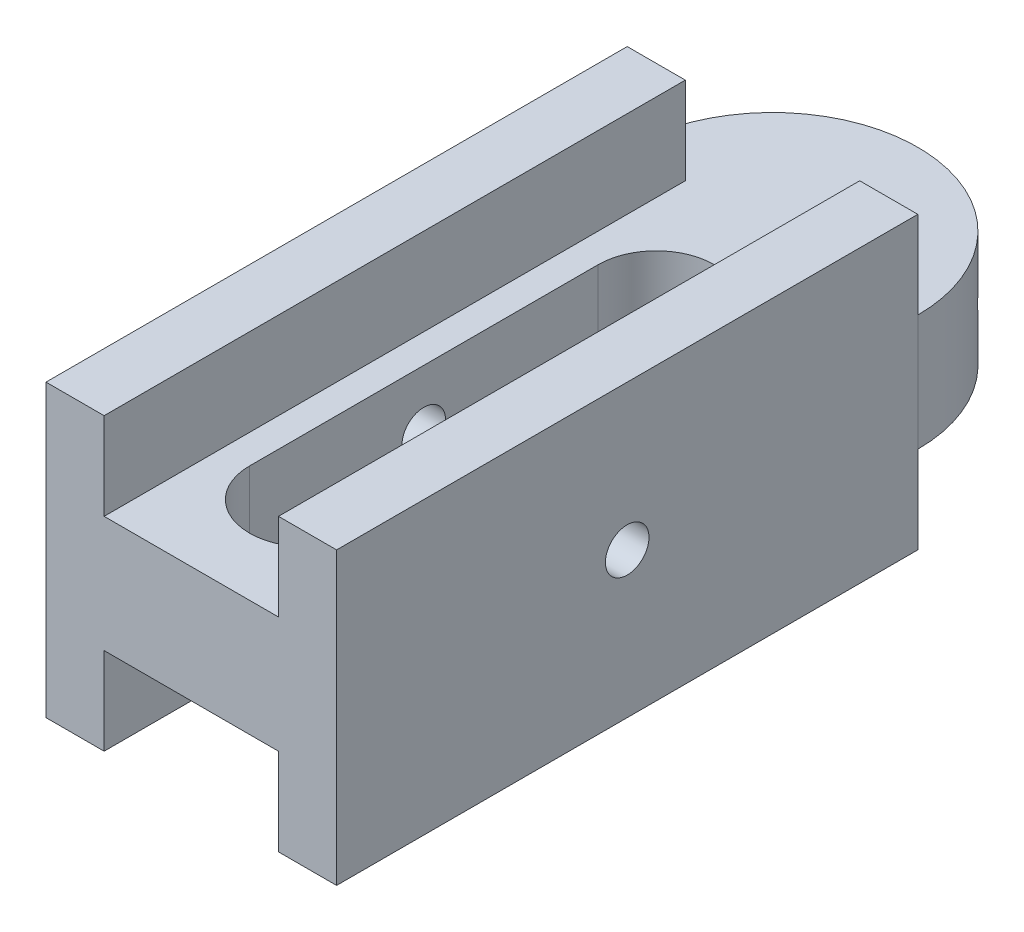
ISO-10303-21;
HEADER;
FILE_DESCRIPTION(('STEP AP214'),'2;1');
FILE_NAME('part.step','',(''),(''),'','','');
FILE_SCHEMA(('AUTOMOTIVE_DESIGN { 1 0 10303 214 1 1 1 1 }'));
ENDSEC;
DATA;
#1=APPLICATION_CONTEXT('core data for automotive mechanical design processes');
#2=APPLICATION_PROTOCOL_DEFINITION('international standard','automotive_design',2000,#1);
#3=PRODUCT_CONTEXT('',#1,'mechanical');
#4=PRODUCT('Part','Part','',(#3));
#5=PRODUCT_RELATED_PRODUCT_CATEGORY('part','',(#4));
#6=PRODUCT_DEFINITION_FORMATION('','',#4);
#7=PRODUCT_DEFINITION_CONTEXT('part definition',#1,'design');
#8=PRODUCT_DEFINITION('design','',#6,#7);
#9=PRODUCT_DEFINITION_SHAPE('','',#8);
#10=(LENGTH_UNIT() NAMED_UNIT(*) SI_UNIT(.MILLI.,.METRE.));
#11=(NAMED_UNIT(*) PLANE_ANGLE_UNIT() SI_UNIT($,.RADIAN.));
#12=(NAMED_UNIT(*) SI_UNIT($,.STERADIAN.) SOLID_ANGLE_UNIT());
#13=UNCERTAINTY_MEASURE_WITH_UNIT(LENGTH_MEASURE(1.E-05),#10,'distance_accuracy_value','');
#14=(GEOMETRIC_REPRESENTATION_CONTEXT(3) GLOBAL_UNCERTAINTY_ASSIGNED_CONTEXT((#13)) GLOBAL_UNIT_ASSIGNED_CONTEXT((#10,
#11,#12)) REPRESENTATION_CONTEXT('',''));
#15=CARTESIAN_POINT('',(0.,0.,0.));
#16=DIRECTION('',(0.,0.,1.));
#17=DIRECTION('',(1.,0.,0.));
#18=AXIS2_PLACEMENT_3D('',#15,#16,#17);
#19=CARTESIAN_POINT('',(-7.9375,0.,15.875));
#20=DIRECTION('',(1.,0.,0.));
#21=DIRECTION('',(0.,0.,-1.));
#22=AXIS2_PLACEMENT_3D('',#19,#20,#21);
#23=CYLINDRICAL_SURFACE('',#22,1.190625);
#24=CARTESIAN_POINT('',(-3.175,0.,15.875));
#25=DIRECTION('',(-1.,0.,0.));
#26=DIRECTION('',(0.,0.,1.));
#27=AXIS2_PLACEMENT_3D('',#24,#25,#26);
#28=CIRCLE('',#27,1.190625);
#29=CARTESIAN_POINT('',(-3.175,0.,17.065625));
#30=VERTEX_POINT('',#29);
#31=EDGE_CURVE('E37',#30,#30,#28,.F.);
#32=ORIENTED_EDGE('',*,*,#31,.T.);
#33=EDGE_LOOP('',(#32));
#34=FACE_BOUND('',#33,.T.);
#35=CARTESIAN_POINT('',(-7.9375,0.,15.875));
#36=DIRECTION('',(1.,0.,0.));
#37=DIRECTION('',(0.,0.,-1.));
#38=AXIS2_PLACEMENT_3D('',#35,#36,#37);
#39=CIRCLE('',#38,1.190625);
#40=CARTESIAN_POINT('',(-7.9375,0.,14.684375));
#41=VERTEX_POINT('',#40);
#42=EDGE_CURVE('E447',#41,#41,#39,.T.);
#43=ORIENTED_EDGE('',*,*,#42,.F.);
#44=EDGE_LOOP('',(#43));
#45=FACE_BOUND('',#44,.T.);
#46=ADVANCED_FACE('F33',(#34,#45),#23,.F.);
#47=CARTESIAN_POINT('',(-7.9375,-7.9375,31.75));
#48=DIRECTION('',(0.,1.,0.));
#49=DIRECTION('',(0.,0.,1.));
#50=AXIS2_PLACEMENT_3D('',#47,#48,#49);
#51=PLANE('',#50);
#52=DIRECTION('',(1.,0.,0.));
#53=VECTOR('',#52,1.);
#54=CARTESIAN_POINT('',(-7.9375,-7.9375,31.75));
#55=LINE('',#54,#53);
#56=CARTESIAN_POINT('',(4.7625,-7.9375,31.75));
#57=VERTEX_POINT('',#56);
#58=CARTESIAN_POINT('',(7.9375,-7.9375,31.75));
#59=VERTEX_POINT('',#58);
#60=EDGE_CURVE('E377',#57,#59,#55,.T.);
#61=ORIENTED_EDGE('',*,*,#60,.F.);
#62=DIRECTION('',(0.,0.,-1.));
#63=VECTOR('',#62,1.);
#64=CARTESIAN_POINT('',(4.7625,-7.9375,31.75));
#65=LINE('',#64,#63);
#66=CARTESIAN_POINT('',(4.7625,-7.9375,0.));
#67=VERTEX_POINT('',#66);
#68=EDGE_CURVE('E216',#57,#67,#65,.T.);
#69=ORIENTED_EDGE('',*,*,#68,.T.);
#70=DIRECTION('',(1.,0.,0.));
#71=VECTOR('',#70,1.);
#72=CARTESIAN_POINT('',(-7.9375,-7.9375,0.));
#73=LINE('',#72,#71);
#74=CARTESIAN_POINT('',(7.9375,-7.9375,0.));
#75=VERTEX_POINT('',#74);
#76=EDGE_CURVE('E393',#67,#75,#73,.T.);
#77=ORIENTED_EDGE('',*,*,#76,.T.);
#78=DIRECTION('',(0.,0.,-1.));
#79=VECTOR('',#78,1.);
#80=CARTESIAN_POINT('',(7.9375,-7.9375,31.75));
#81=LINE('',#80,#79);
#82=EDGE_CURVE('E381',#59,#75,#81,.T.);
#83=ORIENTED_EDGE('',*,*,#82,.F.);
#84=EDGE_LOOP('',(#61,#69,#77,#83));
#85=FACE_BOUND('',#84,.T.);
#86=ADVANCED_FACE('F312',(#85),#51,.F.);
#87=CARTESIAN_POINT('',(0.,0.,0.));
#88=DIRECTION('',(0.,0.,1.));
#89=DIRECTION('',(1.,0.,0.));
#90=AXIS2_PLACEMENT_3D('',#87,#88,#89);
#91=PLANE('',#90);
#92=ORIENTED_EDGE('',*,*,#76,.F.);
#93=DIRECTION('',(0.,-1.,0.));
#94=VECTOR('',#93,1.);
#95=CARTESIAN_POINT('',(4.7625,-7.9375,0.));
#96=LINE('',#95,#94);
#97=CARTESIAN_POINT('',(4.7625,-3.175,0.));
#98=VERTEX_POINT('',#97);
#99=EDGE_CURVE('E207',#98,#67,#96,.T.);
#100=ORIENTED_EDGE('',*,*,#99,.F.);
#101=DIRECTION('',(1.,0.,0.));
#102=VECTOR('',#101,1.);
#103=CARTESIAN_POINT('',(-7.9375,-3.175,0.));
#104=LINE('',#103,#102);
#105=CARTESIAN_POINT('',(7.9375,-3.175,0.));
#106=VERTEX_POINT('',#105);
#107=EDGE_CURVE('E347',#98,#106,#104,.T.);
#108=ORIENTED_EDGE('',*,*,#107,.T.);
#109=DIRECTION('',(0.,1.,0.));
#110=VECTOR('',#109,1.);
#111=CARTESIAN_POINT('',(7.9375,7.9375,0.));
#112=LINE('',#111,#110);
#113=EDGE_CURVE('E382',#75,#106,#112,.T.);
#114=ORIENTED_EDGE('',*,*,#113,.F.);
#115=EDGE_LOOP('',(#92,#100,#108,#114));
#116=FACE_BOUND('',#115,.T.);
#117=ADVANCED_FACE('F317',(#116),#91,.F.);
#118=DIRECTION('',(1.,0.,0.));
#119=VECTOR('',#118,1.);
#120=CARTESIAN_POINT('',(-7.9375,3.175,0.));
#121=LINE('',#120,#119);
#122=CARTESIAN_POINT('',(4.7625,3.175,0.));
#123=VERTEX_POINT('',#122);
#124=CARTESIAN_POINT('',(7.9375,3.175,0.));
#125=VERTEX_POINT('',#124);
#126=EDGE_CURVE('E357',#123,#125,#121,.T.);
#127=ORIENTED_EDGE('',*,*,#126,.F.);
#128=DIRECTION('',(0.,-1.,0.));
#129=VECTOR('',#128,1.);
#130=CARTESIAN_POINT('',(4.7625,7.9375,0.));
#131=LINE('',#130,#129);
#132=CARTESIAN_POINT('',(4.7625,7.9375,0.));
#133=VERTEX_POINT('',#132);
#134=EDGE_CURVE('E219',#133,#123,#131,.T.);
#135=ORIENTED_EDGE('',*,*,#134,.F.);
#136=DIRECTION('',(-1.,0.,0.));
#137=VECTOR('',#136,1.);
#138=CARTESIAN_POINT('',(-7.9375,7.9375,0.));
#139=LINE('',#138,#137);
#140=CARTESIAN_POINT('',(7.9375,7.9375,0.));
#141=VERTEX_POINT('',#140);
#142=EDGE_CURVE('E386',#141,#133,#139,.T.);
#143=ORIENTED_EDGE('',*,*,#142,.F.);
#144=EDGE_CURVE('E365',#125,#141,#112,.T.);
#145=ORIENTED_EDGE('',*,*,#144,.F.);
#146=EDGE_LOOP('',(#127,#135,#143,#145));
#147=FACE_BOUND('',#146,.T.);
#148=ADVANCED_FACE('F419',(#147),#91,.F.);
#149=CARTESIAN_POINT('',(-7.9375,7.9375,31.75));
#150=DIRECTION('',(0.,-1.,0.));
#151=DIRECTION('',(0.,0.,-1.));
#152=AXIS2_PLACEMENT_3D('',#149,#150,#151);
#153=PLANE('',#152);
#154=ORIENTED_EDGE('',*,*,#142,.T.);
#155=DIRECTION('',(0.,0.,-1.));
#156=VECTOR('',#155,1.);
#157=CARTESIAN_POINT('',(4.7625,7.9375,31.75));
#158=LINE('',#157,#156);
#159=CARTESIAN_POINT('',(4.7625,7.9375,31.75));
#160=VERTEX_POINT('',#159);
#161=EDGE_CURVE('E239',#160,#133,#158,.T.);
#162=ORIENTED_EDGE('',*,*,#161,.F.);
#163=DIRECTION('',(-1.,0.,0.));
#164=VECTOR('',#163,1.);
#165=CARTESIAN_POINT('',(-7.9375,7.9375,31.75));
#166=LINE('',#165,#164);
#167=CARTESIAN_POINT('',(7.9375,7.9375,31.75));
#168=VERTEX_POINT('',#167);
#169=EDGE_CURVE('E372',#168,#160,#166,.T.);
#170=ORIENTED_EDGE('',*,*,#169,.F.);
#171=DIRECTION('',(0.,0.,-1.));
#172=VECTOR('',#171,1.);
#173=CARTESIAN_POINT('',(7.9375,7.9375,31.75));
#174=LINE('',#173,#172);
#175=EDGE_CURVE('E292',#168,#141,#174,.T.);
#176=ORIENTED_EDGE('',*,*,#175,.T.);
#177=EDGE_LOOP('',(#154,#162,#170,#176));
#178=FACE_BOUND('',#177,.T.);
#179=ADVANCED_FACE('F409',(#178),#153,.F.);
#180=CARTESIAN_POINT('',(0.,-3.175,0.));
#181=DIRECTION('',(0.,1.,0.));
#182=DIRECTION('',(0.,0.,1.));
#183=AXIS2_PLACEMENT_3D('',#180,#181,#182);
#184=CYLINDRICAL_SURFACE('',#183,7.9375);
#185=CARTESIAN_POINT('',(3.34989133364469,0.,-7.1959804267919));
#186=CARTESIAN_POINT('',(3.34989499809781,0.0882084460911808,-7.19597989683942));
#187=CARTESIAN_POINT('',(3.35672360937426,0.176457964541401,-7.19281197356392));
#188=CARTESIAN_POINT('',(3.38375900295893,0.350460476914997,-7.18013202338388));
#189=CARTESIAN_POINT('',(3.40397648991702,0.436211415859692,-7.17061492014935));
#190=CARTESIAN_POINT('',(3.4569152870931,0.602674219074736,-7.14524303654136));
#191=CARTESIAN_POINT('',(3.48962416019968,0.683391002932965,-7.12939455931131));
#192=CARTESIAN_POINT('',(3.56624862713566,0.837683815956436,-7.0913749068931));
#193=CARTESIAN_POINT('',(3.61016359548189,0.911260243353924,-7.06920408458698));
#194=CARTESIAN_POINT('',(3.70820312500262,1.050228093618,-7.01827737298935));
#195=CARTESIAN_POINT('',(3.7624501328914,1.11550384576581,-6.98944151673078));
#196=CARTESIAN_POINT('',(3.87885992004042,1.23500758455663,-6.92551466995343));
#197=CARTESIAN_POINT('',(3.94102325368344,1.28923479677479,-6.89042324128607));
#198=CARTESIAN_POINT('',(4.0717321149676,1.38555097798518,-6.81400584849534));
#199=CARTESIAN_POINT('',(4.140328548277,1.42753002818391,-6.7726282090224));
#200=CARTESIAN_POINT('',(4.28113730580296,1.49744896256392,-6.68450885173637));
#201=CARTESIAN_POINT('',(4.35334929085493,1.52539016089282,-6.63776763653562));
#202=CARTESIAN_POINT('',(4.49806869554909,1.56608016987115,-6.5405488738458));
#203=CARTESIAN_POINT('',(4.57055968645741,1.57902430189397,-6.49012866993045));
#204=CARTESIAN_POINT('',(4.71452786965753,1.58996213604333,-6.38631393181294));
#205=CARTESIAN_POINT('',(4.78600515897521,1.58795727881274,-6.3329196847133));
#206=CARTESIAN_POINT('',(4.92487510526487,1.56920218890781,-6.22552094060531));
#207=CARTESIAN_POINT('',(4.99231143504519,1.55266234874604,-6.17153596241542));
#208=CARTESIAN_POINT('',(5.12245824178338,1.50564051097151,-6.06394765638732));
#209=CARTESIAN_POINT('',(5.18516852953866,1.4751579555204,-6.01034434390644));
#210=CARTESIAN_POINT('',(5.3048138741224,1.40092106126621,-5.90501945690866));
#211=CARTESIAN_POINT('',(5.36171004530921,1.35708429512099,-5.85331186980904));
#212=CARTESIAN_POINT('',(5.46814184152631,1.2574443398869,-5.7540105222422));
#213=CARTESIAN_POINT('',(5.51767661849346,1.20163977386431,-5.70641723602329));
#214=CARTESIAN_POINT('',(5.60930488441109,1.0784941249028,-5.61638759011891));
#215=CARTESIAN_POINT('',(5.65125362461214,1.01096891606678,-5.57405557339183));
#216=CARTESIAN_POINT('',(5.72592744900618,0.866907647609431,-5.49732084613103));
#217=CARTESIAN_POINT('',(5.75865235874522,0.790371417597928,-5.46291828557248));
#218=CARTESIAN_POINT('',(5.81440971941817,0.630204429482885,-5.40353740052564));
#219=CARTESIAN_POINT('',(5.83742127757342,0.546558838872037,-5.37857940247446));
#220=CARTESIAN_POINT('',(5.87326489155178,0.374695523588165,-5.33941735371019));
#221=CARTESIAN_POINT('',(5.88609827408279,0.286478396404705,-5.32521190143204));
#222=CARTESIAN_POINT('',(5.90123812662552,0.109593287926518,-5.30842931705236));
#223=CARTESIAN_POINT('',(5.90372096757584,0.0209588507823357,-5.30565736930055));
#224=CARTESIAN_POINT('',(5.89860197693303,-0.155651554329497,-5.31134777051729));
#225=CARTESIAN_POINT('',(5.89100071719187,-0.243627559351194,-5.31980948244438));
#226=CARTESIAN_POINT('',(5.86596471799217,-0.415557716463922,-5.34740144161377));
#227=CARTESIAN_POINT('',(5.84862496969507,-0.499542344569272,-5.36642861131444));
#228=CARTESIAN_POINT('',(5.8044590577296,-0.662087955458125,-5.41416773853641));
#229=CARTESIAN_POINT('',(5.77763211259196,-0.740648490816705,-5.44288049385945));
#230=CARTESIAN_POINT('',(5.71449639712169,-0.89124331204588,-5.50913336042268));
#231=CARTESIAN_POINT('',(5.67806859560899,-0.963179186002561,-5.5467836519133));
#232=CARTESIAN_POINT('',(5.59647793365113,-1.09745194530145,-5.62909329627009));
#233=CARTESIAN_POINT('',(5.55131417414103,-1.15978784147069,-5.67375337046186));
#234=CARTESIAN_POINT('',(5.45225060220022,-1.2740680627071,-5.76902548899768));
#235=CARTESIAN_POINT('',(5.39822732539303,-1.32583817675687,-5.81971837787862));
#236=CARTESIAN_POINT('',(5.28299871013941,-1.41628158688059,-5.92451575555225));
#237=CARTESIAN_POINT('',(5.22179367345147,-1.45495543295984,-5.97862010096044));
#238=CARTESIAN_POINT('',(5.09393034229762,-1.51785458389778,-6.0879230386106));
#239=CARTESIAN_POINT('',(5.02730548634586,-1.54216182268417,-6.14311353374363));
#240=CARTESIAN_POINT('',(4.8899860997667,-1.57589735566635,-6.25297264691174));
#241=CARTESIAN_POINT('',(4.81929206036397,-1.58532744191765,-6.30764132701439));
#242=CARTESIAN_POINT('',(4.67707885002185,-1.58897158227858,-6.41378024730014));
#243=CARTESIAN_POINT('',(4.60559544354486,-1.58344755772424,-6.46528959036541));
#244=CARTESIAN_POINT('',(4.4627248551786,-1.55791860350535,-6.56472161300753));
#245=CARTESIAN_POINT('',(4.39133767209073,-1.53791385592243,-6.61264433767442));
#246=CARTESIAN_POINT('',(4.25101480617455,-1.48410772505451,-6.70371284618603));
#247=CARTESIAN_POINT('',(4.18207391878609,-1.45033781221675,-6.74686924283242));
#248=CARTESIAN_POINT('',(4.04862976442952,-1.3699930668872,-6.82778146658114));
#249=CARTESIAN_POINT('',(3.98412684864255,-1.32341722250285,-6.86553686655171));
#250=CARTESIAN_POINT('',(3.86064059001812,-1.21789922303894,-6.93574026095921));
#251=CARTESIAN_POINT('',(3.80176307848985,-1.15876969098599,-6.96809280803989));
#252=CARTESIAN_POINT('',(3.69273952044747,-1.03020774384797,-7.02647956124829));
#253=CARTESIAN_POINT('',(3.64259554517607,-0.960772891968419,-7.05251226913991));
#254=CARTESIAN_POINT('',(3.55238989870142,-0.812674084738428,-7.09838204602718));
#255=CARTESIAN_POINT('',(3.51244264719756,-0.73391877415777,-7.11814935812951));
#256=CARTESIAN_POINT('',(3.44496424777685,-0.570019222386889,-7.15105224302558));
#257=CARTESIAN_POINT('',(3.41742183763666,-0.48488085856762,-7.16419383254237));
#258=CARTESIAN_POINT('',(3.38118889929115,-0.332958351994032,-7.1813475347612));
#259=CARTESIAN_POINT('',(3.36948005429508,-0.267040646524187,-7.18683415880961));
#260=CARTESIAN_POINT('',(3.35383001249162,-0.134089847147481,-7.19415074323093));
#261=CARTESIAN_POINT('',(3.34988854789706,-0.0670567917736246,-7.19598082966618));
#262=CARTESIAN_POINT('',(3.34989133364469,0.,-7.1959804267919));
#263=B_SPLINE_CURVE_WITH_KNOTS('',3,(#185,#186,#187,#188,#189,#190,#191,#192,#193,#194,#195,
#196,#197,#198,#199,#200,#201,#202,#203,#204,#205,#206,#207,#208,#209,#210,#211,#212,#213,#214,
#215,#216,#217,#218,#219,#220,#221,#222,#223,#224,#225,#226,#227,#228,#229,#230,#231,#232,#233,
#234,#235,#236,#237,#238,#239,#240,#241,#242,#243,#244,#245,#246,#247,#248,#249,#250,#251,#252,
#253,#254,#255,#256,#257,#258,#259,#260,#261,#262),.UNSPECIFIED.,.T.,.F.,(4,2,2,2,2,2,2,2,2,2,2,
2,2,2,2,2,2,2,2,2,2,2,2,2,2,2,2,2,2,2,2,2,2,2,2,2,2,2,4),(0.,0.264379811392716,0.52897125486382,
0.79329994048068,1.05761387546503,1.32528075920643,1.59296639806232,1.86298523194452,
2.13297878341414,2.3994149510189,2.66582544234544,2.9284420354324,3.19106913654578,
3.45535129702906,3.7196638803498,3.98858337985442,4.25750796519818,4.52700807786783,
4.79647305587939,5.06132715514792,5.32616623563869,5.58846580081018,5.85078697687607,
6.11652732392052,6.38229503431456,6.65214255251853,6.92197873650291,7.19026079056107,
7.45851052572959,7.72209240145814,7.98567096294726,8.24865027107279,8.51165036513811,
8.77889328840635,9.04619950487527,9.31638501494228,9.58632472953681,9.78731538273572,
9.98829910648691),.UNSPECIFIED.);
#264=CARTESIAN_POINT('',(3.34989133364469,0.,-7.1959804267919));
#265=VERTEX_POINT('',#264);
#266=EDGE_CURVE('E42',#265,#265,#263,.T.);
#267=ORIENTED_EDGE('',*,*,#266,.F.);
#268=EDGE_LOOP('',(#267));
#269=FACE_BOUND('',#268,.T.);
#270=DIRECTION('',(0.,1.,0.));
#271=VECTOR('',#270,1.);
#272=CARTESIAN_POINT('',(-7.9375,-3.175,0.));
#273=LINE('',#272,#271);
#274=CARTESIAN_POINT('',(-7.9375,-3.175,0.));
#275=VERTEX_POINT('',#274);
#276=CARTESIAN_POINT('',(-7.9375,3.175,0.));
#277=VERTEX_POINT('',#276);
#278=EDGE_CURVE('E361',#275,#277,#273,.T.);
#279=ORIENTED_EDGE('',*,*,#278,.T.);
#280=CARTESIAN_POINT('',(0.,3.175,0.));
#281=DIRECTION('',(0.,1.,0.));
#282=DIRECTION('',(0.,0.,-1.));
#283=AXIS2_PLACEMENT_3D('',#280,#281,#282);
#284=CIRCLE('',#283,7.9375);
#285=EDGE_CURVE('E446',#125,#277,#284,.T.);
#286=ORIENTED_EDGE('',*,*,#285,.F.);
#287=DIRECTION('',(0.,1.,0.));
#288=VECTOR('',#287,1.);
#289=CARTESIAN_POINT('',(7.9375,-3.175,0.));
#290=LINE('',#289,#288);
#291=EDGE_CURVE('E362',#106,#125,#290,.T.);
#292=ORIENTED_EDGE('',*,*,#291,.F.);
#293=CARTESIAN_POINT('',(0.,-3.175,0.));
#294=DIRECTION('',(0.,1.,0.));
#295=DIRECTION('',(0.,0.,-1.));
#296=AXIS2_PLACEMENT_3D('',#293,#294,#295);
#297=CIRCLE('',#296,7.9375);
#298=EDGE_CURVE('E346',#106,#275,#297,.T.);
#299=ORIENTED_EDGE('',*,*,#298,.T.);
#300=EDGE_LOOP('',(#279,#286,#292,#299));
#301=FACE_BOUND('',#300,.T.);
#302=CARTESIAN_POINT('',(-7.19598042679191,0.,-3.34989133364469));
#303=CARTESIAN_POINT('',(-7.19597989683942,-0.088208446091181,-3.34989499809781));
#304=CARTESIAN_POINT('',(-7.19281197356392,-0.176457964541402,-3.35672360937426));
#305=CARTESIAN_POINT('',(-7.18013202338388,-0.350460476914998,-3.38375900295892));
#306=CARTESIAN_POINT('',(-7.17061492014935,-0.436211415859692,-3.40397648991702));
#307=CARTESIAN_POINT('',(-7.14524303654136,-0.602674219074737,-3.4569152870931));
#308=CARTESIAN_POINT('',(-7.12939455931131,-0.683391002932966,-3.48962416019968));
#309=CARTESIAN_POINT('',(-7.0913749068931,-0.837683815956437,-3.56624862713566));
#310=CARTESIAN_POINT('',(-7.06920408458698,-0.911260243353925,-3.61016359548189));
#311=CARTESIAN_POINT('',(-7.01827737298936,-1.050228093618,-3.70820312500262));
#312=CARTESIAN_POINT('',(-6.98944151673078,-1.11550384576581,-3.7624501328914));
#313=CARTESIAN_POINT('',(-6.92551466995343,-1.23500758455663,-3.87885992004042));
#314=CARTESIAN_POINT('',(-6.89042324128608,-1.28923479677479,-3.94102325368344));
#315=CARTESIAN_POINT('',(-6.81400584849535,-1.38555097798518,-4.0717321149676));
#316=CARTESIAN_POINT('',(-6.7726282090224,-1.42753002818391,-4.140328548277));
#317=CARTESIAN_POINT('',(-6.68450885173637,-1.49744896256392,-4.28113730580296));
#318=CARTESIAN_POINT('',(-6.63776763653562,-1.52539016089282,-4.35334929085493));
#319=CARTESIAN_POINT('',(-6.5405488738458,-1.56608016987115,-4.49806869554909));
#320=CARTESIAN_POINT('',(-6.49012866993045,-1.57902430189397,-4.57055968645741));
#321=CARTESIAN_POINT('',(-6.38631393181294,-1.58996213604333,-4.71452786965753));
#322=CARTESIAN_POINT('',(-6.3329196847133,-1.58795727881274,-4.78600515897522));
#323=CARTESIAN_POINT('',(-6.22552094060531,-1.56920218890781,-4.92487510526487));
#324=CARTESIAN_POINT('',(-6.17153596241542,-1.55266234874604,-4.99231143504519));
#325=CARTESIAN_POINT('',(-6.06394765638732,-1.50564051097151,-5.12245824178338));
#326=CARTESIAN_POINT('',(-6.01034434390644,-1.4751579555204,-5.18516852953866));
#327=CARTESIAN_POINT('',(-5.90501945690866,-1.40092106126621,-5.3048138741224));
#328=CARTESIAN_POINT('',(-5.85331186980904,-1.35708429512099,-5.36171004530921));
#329=CARTESIAN_POINT('',(-5.75401052224221,-1.2574443398869,-5.46814184152631));
#330=CARTESIAN_POINT('',(-5.70641723602329,-1.20163977386431,-5.51767661849346));
#331=CARTESIAN_POINT('',(-5.61638759011891,-1.0784941249028,-5.60930488441109));
#332=CARTESIAN_POINT('',(-5.57405557339183,-1.01096891606678,-5.65125362461214));
#333=CARTESIAN_POINT('',(-5.49732084613103,-0.866907647609431,-5.72592744900618));
#334=CARTESIAN_POINT('',(-5.46291828557249,-0.790371417597927,-5.75865235874522));
#335=CARTESIAN_POINT('',(-5.40353740052565,-0.630204429482884,-5.81440971941818));
#336=CARTESIAN_POINT('',(-5.37857940247446,-0.546558838872036,-5.83742127757342));
#337=CARTESIAN_POINT('',(-5.33941735371019,-0.374695523588163,-5.87326489155178));
#338=CARTESIAN_POINT('',(-5.32521190143205,-0.286478396404704,-5.88609827408279));
#339=CARTESIAN_POINT('',(-5.30842931705237,-0.109593287926516,-5.90123812662552));
#340=CARTESIAN_POINT('',(-5.30565736930055,-0.0209588507823335,-5.90372096757584));
#341=CARTESIAN_POINT('',(-5.31134777051729,0.155651554329498,-5.89860197693303));
#342=CARTESIAN_POINT('',(-5.31980948244438,0.243627559351196,-5.89100071719187));
#343=CARTESIAN_POINT('',(-5.34740144161377,0.415557716463924,-5.86596471799217));
#344=CARTESIAN_POINT('',(-5.36642861131444,0.499542344569274,-5.84862496969507));
#345=CARTESIAN_POINT('',(-5.41416773853641,0.662087955458127,-5.8044590577296));
#346=CARTESIAN_POINT('',(-5.44288049385945,0.740648490816707,-5.77763211259196));
#347=CARTESIAN_POINT('',(-5.50913336042268,0.891243312045882,-5.71449639712169));
#348=CARTESIAN_POINT('',(-5.5467836519133,0.963179186002563,-5.67806859560899));
#349=CARTESIAN_POINT('',(-5.6290932962701,1.09745194530145,-5.59647793365113));
#350=CARTESIAN_POINT('',(-5.67375337046186,1.15978784147069,-5.55131417414103));
#351=CARTESIAN_POINT('',(-5.76902548899769,1.2740680627071,-5.45225060220022));
#352=CARTESIAN_POINT('',(-5.81971837787863,1.32583817675687,-5.39822732539303));
#353=CARTESIAN_POINT('',(-5.92451575555226,1.41628158688059,-5.28299871013941));
#354=CARTESIAN_POINT('',(-5.97862010096044,1.45495543295984,-5.22179367345147));
#355=CARTESIAN_POINT('',(-6.08792303861061,1.51785458389778,-5.09393034229762));
#356=CARTESIAN_POINT('',(-6.14311353374363,1.54216182268417,-5.02730548634586));
#357=CARTESIAN_POINT('',(-6.25297264691174,1.57589735566635,-4.8899860997667));
#358=CARTESIAN_POINT('',(-6.30764132701439,1.58532744191765,-4.81929206036397));
#359=CARTESIAN_POINT('',(-6.41378024730014,1.58897158227858,-4.67707885002185));
#360=CARTESIAN_POINT('',(-6.46528959036541,1.58344755772424,-4.60559544354486));
#361=CARTESIAN_POINT('',(-6.56472161300753,1.55791860350535,-4.4627248551786));
#362=CARTESIAN_POINT('',(-6.61264433767442,1.53791385592243,-4.39133767209073));
#363=CARTESIAN_POINT('',(-6.70371284618604,1.48410772505451,-4.25101480617455));
#364=CARTESIAN_POINT('',(-6.74686924283242,1.45033781221674,-4.18207391878609));
#365=CARTESIAN_POINT('',(-6.82778146658114,1.3699930668872,-4.04862976442952));
#366=CARTESIAN_POINT('',(-6.86553686655171,1.32341722250285,-3.98412684864256));
#367=CARTESIAN_POINT('',(-6.93574026095921,1.21789922303894,-3.86064059001812));
#368=CARTESIAN_POINT('',(-6.96809280803989,1.15876969098599,-3.80176307848985));
#369=CARTESIAN_POINT('',(-7.02647956124829,1.03020774384797,-3.69273952044747));
#370=CARTESIAN_POINT('',(-7.05251226913992,0.960772891968418,-3.64259554517607));
#371=CARTESIAN_POINT('',(-7.09838204602718,0.812674084738427,-3.55238989870142));
#372=CARTESIAN_POINT('',(-7.11814935812951,0.733918774157768,-3.51244264719756));
#373=CARTESIAN_POINT('',(-7.15105224302559,0.570019222386887,-3.44496424777685));
#374=CARTESIAN_POINT('',(-7.16419383254237,0.484880858567619,-3.41742183763666));
#375=CARTESIAN_POINT('',(-7.18134753476121,0.33295835199403,-3.38118889929115));
#376=CARTESIAN_POINT('',(-7.18683415880961,0.267040646524185,-3.36948005429508));
#377=CARTESIAN_POINT('',(-7.19415074323094,0.134089847147479,-3.35383001249162));
#378=CARTESIAN_POINT('',(-7.19598082966618,0.0670567917736238,-3.34988854789706));
#379=CARTESIAN_POINT('',(-7.19598042679191,0.,-3.34989133364469));
#380=B_SPLINE_CURVE_WITH_KNOTS('',3,(#302,#303,#304,#305,#306,#307,#308,#309,#310,#311,#312,
#313,#314,#315,#316,#317,#318,#319,#320,#321,#322,#323,#324,#325,#326,#327,#328,#329,#330,#331,
#332,#333,#334,#335,#336,#337,#338,#339,#340,#341,#342,#343,#344,#345,#346,#347,#348,#349,#350,
#351,#352,#353,#354,#355,#356,#357,#358,#359,#360,#361,#362,#363,#364,#365,#366,#367,#368,#369,
#370,#371,#372,#373,#374,#375,#376,#377,#378,#379),.UNSPECIFIED.,.T.,.F.,(4,2,2,2,2,2,2,2,2,2,2,
2,2,2,2,2,2,2,2,2,2,2,2,2,2,2,2,2,2,2,2,2,2,2,2,2,2,2,4),(0.,0.264379811392717,
0.528971254863821,0.793299940480681,1.05761387546503,1.32528075920643,1.59296639806232,
1.86298523194452,2.13297878341414,2.3994149510189,2.66582544234544,2.92844203543241,
3.19106913654579,3.45535129702906,3.7196638803498,3.98858337985442,4.25750796519818,
4.52700807786783,4.79647305587939,5.06132715514792,5.32616623563869,5.58846580081019,
5.85078697687608,6.11652732392052,6.38229503431457,6.65214255251853,6.92197873650291,
7.19026079056107,7.45851052572959,7.72209240145814,7.98567096294726,8.2486502710728,
8.51165036513811,8.77889328840635,9.04619950487527,9.31638501494228,9.5863247295368,
9.78731538273572,9.98829910648691),.UNSPECIFIED.);
#381=CARTESIAN_POINT('',(-7.19598042679191,0.,-3.34989133364469));
#382=VERTEX_POINT('',#381);
#383=EDGE_CURVE('E254',#382,#382,#380,.T.);
#384=ORIENTED_EDGE('',*,*,#383,.T.);
#385=EDGE_LOOP('',(#384));
#386=FACE_BOUND('',#385,.T.);
#387=ADVANCED_FACE('F263',(#269,#301,#386),#184,.T.);
#388=CARTESIAN_POINT('',(0.,0.,0.));
#389=DIRECTION('',(0.594822786751339,0.,-0.803856860617219));
#390=DIRECTION('',(-0.803856860617219,0.,-0.594822786751339));
#391=AXIS2_PLACEMENT_3D('',#388,#389,#390);
#392=CYLINDRICAL_SURFACE('',#391,1.5875);
#393=ORIENTED_EDGE('',*,*,#266,.T.);
#394=EDGE_LOOP('',(#393));
#395=FACE_BOUND('',#394,.T.);
#396=CARTESIAN_POINT('',(0.,0.,0.));
#397=DIRECTION('',(0.989015863361916,0.,-0.147809411129613));
#398=DIRECTION('',(-0.147809411129613,0.,-0.989015863361916));
#399=AXIS2_PLACEMENT_3D('',#396,#397,#398);
#400=ELLIPSE('',#399,2.24506403026729,1.5875);
#401=CARTESIAN_POINT('',(0.,-1.5875,0.));
#402=VERTEX_POINT('',#401);
#403=CARTESIAN_POINT('',(0.,1.5875,0.));
#404=VERTEX_POINT('',#403);
#405=EDGE_CURVE('E251',#402,#404,#400,.T.);
#406=ORIENTED_EDGE('',*,*,#405,.F.);
#407=CARTESIAN_POINT('',(0.,0.,0.));
#408=DIRECTION('',(0.594822786751339,0.,-0.803856860617219));
#409=DIRECTION('',(-0.803856860617219,0.,-0.594822786751339));
#410=AXIS2_PLACEMENT_3D('',#407,#408,#409);
#411=CIRCLE('',#410,1.5875);
#412=EDGE_CURVE('E261',#404,#402,#411,.T.);
#413=ORIENTED_EDGE('',*,*,#412,.F.);
#414=EDGE_LOOP('',(#406,#413));
#415=FACE_BOUND('',#414,.T.);
#416=ADVANCED_FACE('F280',(#395,#415),#392,.F.);
#417=CARTESIAN_POINT('',(-4.7625,7.9375,0.));
#418=VERTEX_POINT('',#417);
#419=CARTESIAN_POINT('',(-7.9375,7.9375,0.));
#420=VERTEX_POINT('',#419);
#421=EDGE_CURVE('E385',#418,#420,#139,.T.);
#422=ORIENTED_EDGE('',*,*,#421,.F.);
#423=DIRECTION('',(0.,1.,0.));
#424=VECTOR('',#423,1.);
#425=CARTESIAN_POINT('',(-4.7625,7.9375,0.));
#426=LINE('',#425,#424);
#427=CARTESIAN_POINT('',(-4.7625,3.175,0.));
#428=VERTEX_POINT('',#427);
#429=EDGE_CURVE('E230',#428,#418,#426,.T.);
#430=ORIENTED_EDGE('',*,*,#429,.F.);
#431=EDGE_CURVE('E353',#277,#428,#121,.T.);
#432=ORIENTED_EDGE('',*,*,#431,.F.);
#433=DIRECTION('',(0.,-1.,0.));
#434=VECTOR('',#433,1.);
#435=CARTESIAN_POINT('',(-7.9375,7.9375,0.));
#436=LINE('',#435,#434);
#437=EDGE_CURVE('E390',#420,#277,#436,.T.);
#438=ORIENTED_EDGE('',*,*,#437,.F.);
#439=EDGE_LOOP('',(#422,#430,#432,#438));
#440=FACE_BOUND('',#439,.T.);
#441=ADVANCED_FACE('F284',(#440),#91,.F.);
#442=CARTESIAN_POINT('',(7.9375,7.9375,31.75));
#443=DIRECTION('',(-1.,0.,0.));
#444=DIRECTION('',(0.,0.,1.));
#445=AXIS2_PLACEMENT_3D('',#442,#443,#444);
#446=PLANE('',#445);
#447=CARTESIAN_POINT('',(7.9375,0.,15.875));
#448=DIRECTION('',(1.,0.,0.));
#449=DIRECTION('',(0.,0.,-1.));
#450=AXIS2_PLACEMENT_3D('',#447,#448,#449);
#451=CIRCLE('',#450,1.190625);
#452=CARTESIAN_POINT('',(7.9375,0.,14.684375));
#453=VERTEX_POINT('',#452);
#454=EDGE_CURVE('E449',#453,#453,#451,.T.);
#455=ORIENTED_EDGE('',*,*,#454,.F.);
#456=EDGE_LOOP('',(#455));
#457=FACE_BOUND('',#456,.T.);
#458=ORIENTED_EDGE('',*,*,#113,.T.);
#459=ORIENTED_EDGE('',*,*,#291,.T.);
#460=ORIENTED_EDGE('',*,*,#144,.T.);
#461=ORIENTED_EDGE('',*,*,#175,.F.);
#462=DIRECTION('',(0.,1.,0.));
#463=VECTOR('',#462,1.);
#464=CARTESIAN_POINT('',(7.9375,7.9375,31.75));
#465=LINE('',#464,#463);
#466=EDGE_CURVE('E367',#59,#168,#465,.T.);
#467=ORIENTED_EDGE('',*,*,#466,.F.);
#468=ORIENTED_EDGE('',*,*,#82,.T.);
#469=EDGE_LOOP('',(#458,#459,#460,#461,#467,#468));
#470=FACE_BOUND('',#469,.T.);
#471=ADVANCED_FACE('F35',(#457,#470),#446,.F.);
#472=CARTESIAN_POINT('',(-4.7625,7.9375,31.75));
#473=VERTEX_POINT('',#472);
#474=CARTESIAN_POINT('',(-7.9375,7.9375,31.75));
#475=VERTEX_POINT('',#474);
#476=EDGE_CURVE('E370',#473,#475,#166,.T.);
#477=ORIENTED_EDGE('',*,*,#476,.F.);
#478=DIRECTION('',(0.,0.,-1.));
#479=VECTOR('',#478,1.);
#480=CARTESIAN_POINT('',(-4.7625,7.9375,31.75));
#481=LINE('',#480,#479);
#482=EDGE_CURVE('E242',#473,#418,#481,.T.);
#483=ORIENTED_EDGE('',*,*,#482,.T.);
#484=ORIENTED_EDGE('',*,*,#421,.T.);
#485=DIRECTION('',(0.,0.,-1.));
#486=VECTOR('',#485,1.);
#487=CARTESIAN_POINT('',(-7.9375,7.9375,31.75));
#488=LINE('',#487,#486);
#489=EDGE_CURVE('E400',#475,#420,#488,.T.);
#490=ORIENTED_EDGE('',*,*,#489,.F.);
#491=EDGE_LOOP('',(#477,#483,#484,#490));
#492=FACE_BOUND('',#491,.T.);
#493=ADVANCED_FACE('F563',(#492),#153,.F.);
#494=CARTESIAN_POINT('',(-7.9375,7.9375,31.75));
#495=DIRECTION('',(1.,0.,0.));
#496=DIRECTION('',(0.,0.,-1.));
#497=AXIS2_PLACEMENT_3D('',#494,#495,#496);
#498=PLANE('',#497);
#499=ORIENTED_EDGE('',*,*,#42,.T.);
#500=EDGE_LOOP('',(#499));
#501=FACE_BOUND('',#500,.T.);
#502=ORIENTED_EDGE('',*,*,#437,.T.);
#503=ORIENTED_EDGE('',*,*,#278,.F.);
#504=CARTESIAN_POINT('',(-7.9375,-7.9375,0.));
#505=VERTEX_POINT('',#504);
#506=EDGE_CURVE('E389',#275,#505,#436,.T.);
#507=ORIENTED_EDGE('',*,*,#506,.T.);
#508=DIRECTION('',(0.,0.,-1.));
#509=VECTOR('',#508,1.);
#510=CARTESIAN_POINT('',(-7.9375,-7.9375,31.75));
#511=LINE('',#510,#509);
#512=CARTESIAN_POINT('',(-7.9375,-7.9375,31.75));
#513=VERTEX_POINT('',#512);
#514=EDGE_CURVE('E398',#513,#505,#511,.T.);
#515=ORIENTED_EDGE('',*,*,#514,.F.);
#516=DIRECTION('',(0.,-1.,0.));
#517=VECTOR('',#516,1.);
#518=CARTESIAN_POINT('',(-7.9375,7.9375,31.75));
#519=LINE('',#518,#517);
#520=EDGE_CURVE('E375',#475,#513,#519,.T.);
#521=ORIENTED_EDGE('',*,*,#520,.F.);
#522=ORIENTED_EDGE('',*,*,#489,.T.);
#523=EDGE_LOOP('',(#502,#503,#507,#515,#521,#522));
#524=FACE_BOUND('',#523,.T.);
#525=ADVANCED_FACE('F444',(#501,#524),#498,.F.);
#526=CARTESIAN_POINT('',(-4.7625,-7.9375,0.));
#527=VERTEX_POINT('',#526);
#528=EDGE_CURVE('E371',#505,#527,#73,.T.);
#529=ORIENTED_EDGE('',*,*,#528,.T.);
#530=DIRECTION('',(0.,0.,-1.));
#531=VECTOR('',#530,1.);
#532=CARTESIAN_POINT('',(-4.7625,-7.9375,31.75));
#533=LINE('',#532,#531);
#534=CARTESIAN_POINT('',(-4.7625,-7.9375,31.75));
#535=VERTEX_POINT('',#534);
#536=EDGE_CURVE('E213',#535,#527,#533,.T.);
#537=ORIENTED_EDGE('',*,*,#536,.F.);
#538=EDGE_CURVE('E378',#513,#535,#55,.T.);
#539=ORIENTED_EDGE('',*,*,#538,.F.);
#540=ORIENTED_EDGE('',*,*,#514,.T.);
#541=EDGE_LOOP('',(#529,#537,#539,#540));
#542=FACE_BOUND('',#541,.T.);
#543=ADVANCED_FACE('F320',(#542),#51,.F.);
#544=CARTESIAN_POINT('',(0.,0.,31.75));
#545=DIRECTION('',(0.,0.,1.));
#546=DIRECTION('',(1.,0.,0.));
#547=AXIS2_PLACEMENT_3D('',#544,#545,#546);
#548=PLANE('',#547);
#549=DIRECTION('',(0.,-1.,0.));
#550=VECTOR('',#549,1.);
#551=CARTESIAN_POINT('',(4.7625,-7.9375,31.75));
#552=LINE('',#551,#550);
#553=CARTESIAN_POINT('',(4.7625,-3.175,31.75));
#554=VERTEX_POINT('',#553);
#555=EDGE_CURVE('E210',#554,#57,#552,.T.);
#556=ORIENTED_EDGE('',*,*,#555,.T.);
#557=ORIENTED_EDGE('',*,*,#60,.T.);
#558=ORIENTED_EDGE('',*,*,#466,.T.);
#559=ORIENTED_EDGE('',*,*,#169,.T.);
#560=DIRECTION('',(0.,-1.,0.));
#561=VECTOR('',#560,1.);
#562=CARTESIAN_POINT('',(4.7625,7.9375,31.75));
#563=LINE('',#562,#561);
#564=CARTESIAN_POINT('',(4.7625,3.175,31.75));
#565=VERTEX_POINT('',#564);
#566=EDGE_CURVE('E226',#160,#565,#563,.T.);
#567=ORIENTED_EDGE('',*,*,#566,.T.);
#568=DIRECTION('',(-1.,0.,0.));
#569=VECTOR('',#568,1.);
#570=CARTESIAN_POINT('',(4.7625,3.175,31.75));
#571=LINE('',#570,#569);
#572=CARTESIAN_POINT('',(-4.7625,3.175,31.75));
#573=VERTEX_POINT('',#572);
#574=EDGE_CURVE('E229',#565,#573,#571,.T.);
#575=ORIENTED_EDGE('',*,*,#574,.T.);
#576=DIRECTION('',(0.,1.,0.));
#577=VECTOR('',#576,1.);
#578=CARTESIAN_POINT('',(-4.7625,7.9375,31.75));
#579=LINE('',#578,#577);
#580=EDGE_CURVE('E233',#573,#473,#579,.T.);
#581=ORIENTED_EDGE('',*,*,#580,.T.);
#582=ORIENTED_EDGE('',*,*,#476,.T.);
#583=ORIENTED_EDGE('',*,*,#520,.T.);
#584=ORIENTED_EDGE('',*,*,#538,.T.);
#585=DIRECTION('',(0.,1.,0.));
#586=VECTOR('',#585,1.);
#587=CARTESIAN_POINT('',(-4.7625,-7.9375,31.75));
#588=LINE('',#587,#586);
#589=CARTESIAN_POINT('',(-4.7625,-3.175,31.75));
#590=VERTEX_POINT('',#589);
#591=EDGE_CURVE('E203',#535,#590,#588,.T.);
#592=ORIENTED_EDGE('',*,*,#591,.T.);
#593=DIRECTION('',(1.,0.,0.));
#594=VECTOR('',#593,1.);
#595=CARTESIAN_POINT('',(4.7625,-3.175,31.75));
#596=LINE('',#595,#594);
#597=EDGE_CURVE('E206',#590,#554,#596,.T.);
#598=ORIENTED_EDGE('',*,*,#597,.T.);
#599=EDGE_LOOP('',(#556,#557,#558,#559,#567,#575,#581,#582,#583,#584,#592,#598));
#600=FACE_BOUND('',#599,.T.);
#601=ADVANCED_FACE('F336',(#600),#548,.T.);
#602=CARTESIAN_POINT('',(-4.7625,-3.175,0.));
#603=VERTEX_POINT('',#602);
#604=EDGE_CURVE('E349',#275,#603,#104,.T.);
#605=ORIENTED_EDGE('',*,*,#604,.T.);
#606=DIRECTION('',(0.,1.,0.));
#607=VECTOR('',#606,1.);
#608=CARTESIAN_POINT('',(-4.7625,-7.9375,0.));
#609=LINE('',#608,#607);
#610=EDGE_CURVE('E202',#527,#603,#609,.T.);
#611=ORIENTED_EDGE('',*,*,#610,.F.);
#612=ORIENTED_EDGE('',*,*,#528,.F.);
#613=ORIENTED_EDGE('',*,*,#506,.F.);
#614=EDGE_LOOP('',(#605,#611,#612,#613));
#615=FACE_BOUND('',#614,.T.);
#616=ADVANCED_FACE('F331',(#615),#91,.F.);
#617=CARTESIAN_POINT('',(0.,-3.175,0.));
#618=DIRECTION('',(0.,-1.,0.));
#619=DIRECTION('',(0.,0.,-1.));
#620=AXIS2_PLACEMENT_3D('',#617,#618,#619);
#621=PLANE('',#620);
#622=CARTESIAN_POINT('',(0.,-3.175,25.4));
#623=DIRECTION('',(0.,-1.,0.));
#624=DIRECTION('',(0.,0.,-1.));
#625=AXIS2_PLACEMENT_3D('',#622,#623,#624);
#626=CIRCLE('',#625,3.175);
#627=CARTESIAN_POINT('',(3.175,-3.175,25.4));
#628=VERTEX_POINT('',#627);
#629=CARTESIAN_POINT('',(-3.175,-3.175,25.4));
#630=VERTEX_POINT('',#629);
#631=EDGE_CURVE('E200',#628,#630,#626,.T.);
#632=ORIENTED_EDGE('',*,*,#631,.F.);
#633=DIRECTION('',(0.,0.,1.));
#634=VECTOR('',#633,1.);
#635=CARTESIAN_POINT('',(3.17499999999999,-3.175,0.));
#636=LINE('',#635,#634);
#637=CARTESIAN_POINT('',(3.175,-3.175,6.35));
#638=VERTEX_POINT('',#637);
#639=EDGE_CURVE('E195',#638,#628,#636,.T.);
#640=ORIENTED_EDGE('',*,*,#639,.F.);
#641=CARTESIAN_POINT('',(0.,-3.175,6.35));
#642=DIRECTION('',(0.,-1.,0.));
#643=DIRECTION('',(0.,0.,-1.));
#644=AXIS2_PLACEMENT_3D('',#641,#642,#643);
#645=CIRCLE('',#644,3.175);
#646=CARTESIAN_POINT('',(-3.175,-3.175,6.35));
#647=VERTEX_POINT('',#646);
#648=EDGE_CURVE('E171',#647,#638,#645,.T.);
#649=ORIENTED_EDGE('',*,*,#648,.F.);
#650=DIRECTION('',(0.,0.,-1.));
#651=VECTOR('',#650,1.);
#652=CARTESIAN_POINT('',(-3.175,-3.175,0.));
#653=LINE('',#652,#651);
#654=EDGE_CURVE('E197',#630,#647,#653,.T.);
#655=ORIENTED_EDGE('',*,*,#654,.F.);
#656=EDGE_LOOP('',(#632,#640,#649,#655));
#657=FACE_BOUND('',#656,.T.);
#658=ORIENTED_EDGE('',*,*,#298,.F.);
#659=ORIENTED_EDGE('',*,*,#107,.F.);
#660=DIRECTION('',(0.,0.,-1.));
#661=VECTOR('',#660,1.);
#662=CARTESIAN_POINT('',(4.7625,-3.175,31.75));
#663=LINE('',#662,#661);
#664=EDGE_CURVE('E220',#554,#98,#663,.T.);
#665=ORIENTED_EDGE('',*,*,#664,.F.);
#666=ORIENTED_EDGE('',*,*,#597,.F.);
#667=DIRECTION('',(0.,0.,-1.));
#668=VECTOR('',#667,1.);
#669=CARTESIAN_POINT('',(-4.7625,-3.175,31.75));
#670=LINE('',#669,#668);
#671=EDGE_CURVE('E222',#590,#603,#670,.T.);
#672=ORIENTED_EDGE('',*,*,#671,.T.);
#673=ORIENTED_EDGE('',*,*,#604,.F.);
#674=EDGE_LOOP('',(#658,#659,#665,#666,#672,#673));
#675=FACE_BOUND('',#674,.T.);
#676=ADVANCED_FACE('F327',(#657,#675),#621,.T.);
#677=CARTESIAN_POINT('',(0.,3.175,0.));
#678=DIRECTION('',(0.,-1.,0.));
#679=DIRECTION('',(0.,0.,-1.));
#680=AXIS2_PLACEMENT_3D('',#677,#678,#679);
#681=PLANE('',#680);
#682=DIRECTION('',(0.,0.,-1.));
#683=VECTOR('',#682,1.);
#684=CARTESIAN_POINT('',(3.175,3.175,25.4));
#685=LINE('',#684,#683);
#686=CARTESIAN_POINT('',(3.175,3.175,25.4));
#687=VERTEX_POINT('',#686);
#688=CARTESIAN_POINT('',(3.175,3.175,6.35));
#689=VERTEX_POINT('',#688);
#690=EDGE_CURVE('E177',#687,#689,#685,.T.);
#691=ORIENTED_EDGE('',*,*,#690,.F.);
#692=CARTESIAN_POINT('',(0.,3.175,25.4));
#693=DIRECTION('',(0.,1.,0.));
#694=DIRECTION('',(0.,0.,1.));
#695=AXIS2_PLACEMENT_3D('',#692,#693,#694);
#696=CIRCLE('',#695,3.175);
#697=CARTESIAN_POINT('',(-3.175,3.175,25.4));
#698=VERTEX_POINT('',#697);
#699=EDGE_CURVE('E58',#698,#687,#696,.T.);
#700=ORIENTED_EDGE('',*,*,#699,.F.);
#701=DIRECTION('',(0.,0.,1.));
#702=VECTOR('',#701,1.);
#703=CARTESIAN_POINT('',(-3.175,3.175,25.4));
#704=LINE('',#703,#702);
#705=CARTESIAN_POINT('',(-3.175,3.175,6.35));
#706=VERTEX_POINT('',#705);
#707=EDGE_CURVE('E185',#706,#698,#704,.T.);
#708=ORIENTED_EDGE('',*,*,#707,.F.);
#709=CARTESIAN_POINT('',(0.,3.175,6.35));
#710=DIRECTION('',(0.,1.,0.));
#711=DIRECTION('',(0.,0.,1.));
#712=AXIS2_PLACEMENT_3D('',#709,#710,#711);
#713=CIRCLE('',#712,3.175);
#714=EDGE_CURVE('E168',#689,#706,#713,.T.);
#715=ORIENTED_EDGE('',*,*,#714,.F.);
#716=EDGE_LOOP('',(#691,#700,#708,#715));
#717=FACE_BOUND('',#716,.T.);
#718=ORIENTED_EDGE('',*,*,#285,.T.);
#719=ORIENTED_EDGE('',*,*,#431,.T.);
#720=DIRECTION('',(0.,0.,-1.));
#721=VECTOR('',#720,1.);
#722=CARTESIAN_POINT('',(-4.7625,3.175,31.75));
#723=LINE('',#722,#721);
#724=EDGE_CURVE('E245',#573,#428,#723,.T.);
#725=ORIENTED_EDGE('',*,*,#724,.F.);
#726=ORIENTED_EDGE('',*,*,#574,.F.);
#727=DIRECTION('',(0.,0.,-1.));
#728=VECTOR('',#727,1.);
#729=CARTESIAN_POINT('',(4.7625,3.175,31.75));
#730=LINE('',#729,#728);
#731=EDGE_CURVE('E236',#565,#123,#730,.T.);
#732=ORIENTED_EDGE('',*,*,#731,.T.);
#733=ORIENTED_EDGE('',*,*,#126,.T.);
#734=EDGE_LOOP('',(#718,#719,#725,#726,#732,#733));
#735=FACE_BOUND('',#734,.T.);
#736=ADVANCED_FACE('F182',(#717,#735),#681,.F.);
#737=CARTESIAN_POINT('',(3.175,0.,15.875));
#738=DIRECTION('',(1.,0.,0.));
#739=DIRECTION('',(0.,0.,-1.));
#740=AXIS2_PLACEMENT_3D('',#737,#738,#739);
#741=CIRCLE('',#740,1.190625);
#742=CARTESIAN_POINT('',(3.175,0.,14.684375));
#743=VERTEX_POINT('',#742);
#744=EDGE_CURVE('E192',#743,#743,#741,.F.);
#745=ORIENTED_EDGE('',*,*,#744,.T.);
#746=EDGE_LOOP('',(#745));
#747=FACE_BOUND('',#746,.T.);
#748=ORIENTED_EDGE('',*,*,#454,.T.);
#749=EDGE_LOOP('',(#748));
#750=FACE_BOUND('',#749,.T.);
#751=ADVANCED_FACE('F278',(#747,#750),#23,.F.);
#752=CARTESIAN_POINT('',(0.,0.,0.));
#753=DIRECTION('',(0.594822786751339,0.,-0.803856860617219));
#754=DIRECTION('',(-0.803856860617219,0.,-0.594822786751339));
#755=AXIS2_PLACEMENT_3D('',#752,#753,#754);
#756=PLANE('',#755);
#757=DIRECTION('',(0.,-1.,0.));
#758=VECTOR('',#757,1.);
#759=CARTESIAN_POINT('',(0.,0.,0.));
#760=LINE('',#759,#758);
#761=EDGE_CURVE('E11',#404,#402,#760,.T.);
#762=ORIENTED_EDGE('',*,*,#761,.F.);
#763=ORIENTED_EDGE('',*,*,#412,.T.);
#764=EDGE_LOOP('',(#762,#763));
#765=FACE_BOUND('',#764,.T.);
#766=ADVANCED_FACE('F273',(#765),#756,.T.);
#767=CARTESIAN_POINT('',(0.,0.,0.));
#768=DIRECTION('',(-0.803856860617219,0.,-0.594822786751339));
#769=DIRECTION('',(-0.594822786751339,0.,0.803856860617219));
#770=AXIS2_PLACEMENT_3D('',#767,#768,#769);
#771=CYLINDRICAL_SURFACE('',#770,1.5875);
#772=ORIENTED_EDGE('',*,*,#383,.F.);
#773=EDGE_LOOP('',(#772));
#774=FACE_BOUND('',#773,.T.);
#775=ORIENTED_EDGE('',*,*,#405,.T.);
#776=CARTESIAN_POINT('',(0.,0.,0.));
#777=DIRECTION('',(0.803856860617219,0.,0.594822786751339));
#778=DIRECTION('',(0.594822786751339,0.,-0.803856860617219));
#779=AXIS2_PLACEMENT_3D('',#776,#777,#778);
#780=CIRCLE('',#779,1.5875);
#781=EDGE_CURVE('E241',#404,#402,#780,.T.);
#782=ORIENTED_EDGE('',*,*,#781,.T.);
#783=EDGE_LOOP('',(#775,#782));
#784=FACE_BOUND('',#783,.T.);
#785=ADVANCED_FACE('F267',(#774,#784),#771,.F.);
#786=CARTESIAN_POINT('',(0.,0.,0.));
#787=DIRECTION('',(0.803856860617219,0.,0.594822786751339));
#788=DIRECTION('',(0.594822786751339,0.,-0.803856860617219));
#789=AXIS2_PLACEMENT_3D('',#786,#787,#788);
#790=PLANE('',#789);
#791=ORIENTED_EDGE('',*,*,#761,.T.);
#792=ORIENTED_EDGE('',*,*,#781,.F.);
#793=EDGE_LOOP('',(#791,#792));
#794=FACE_BOUND('',#793,.T.);
#795=ADVANCED_FACE('F272',(#794),#790,.F.);
#796=CARTESIAN_POINT('',(4.7625,7.9375,31.75));
#797=DIRECTION('',(1.,0.,0.));
#798=DIRECTION('',(0.,1.,0.));
#799=AXIS2_PLACEMENT_3D('',#796,#797,#798);
#800=PLANE('',#799);
#801=ORIENTED_EDGE('',*,*,#134,.T.);
#802=ORIENTED_EDGE('',*,*,#731,.F.);
#803=ORIENTED_EDGE('',*,*,#566,.F.);
#804=ORIENTED_EDGE('',*,*,#161,.T.);
#805=EDGE_LOOP('',(#801,#802,#803,#804));
#806=FACE_BOUND('',#805,.T.);
#807=ADVANCED_FACE('F421',(#806),#800,.F.);
#808=CARTESIAN_POINT('',(-4.7625,7.9375,31.75));
#809=DIRECTION('',(-1.,0.,0.));
#810=DIRECTION('',(0.,-1.,0.));
#811=AXIS2_PLACEMENT_3D('',#808,#809,#810);
#812=PLANE('',#811);
#813=ORIENTED_EDGE('',*,*,#429,.T.);
#814=ORIENTED_EDGE('',*,*,#482,.F.);
#815=ORIENTED_EDGE('',*,*,#580,.F.);
#816=ORIENTED_EDGE('',*,*,#724,.T.);
#817=EDGE_LOOP('',(#813,#814,#815,#816));
#818=FACE_BOUND('',#817,.T.);
#819=ADVANCED_FACE('F464',(#818),#812,.F.);
#820=CARTESIAN_POINT('',(4.7625,-7.9375,31.75));
#821=DIRECTION('',(1.,0.,0.));
#822=DIRECTION('',(0.,1.,0.));
#823=AXIS2_PLACEMENT_3D('',#820,#821,#822);
#824=PLANE('',#823);
#825=ORIENTED_EDGE('',*,*,#99,.T.);
#826=ORIENTED_EDGE('',*,*,#68,.F.);
#827=ORIENTED_EDGE('',*,*,#555,.F.);
#828=ORIENTED_EDGE('',*,*,#664,.T.);
#829=EDGE_LOOP('',(#825,#826,#827,#828));
#830=FACE_BOUND('',#829,.T.);
#831=ADVANCED_FACE('F434',(#830),#824,.F.);
#832=CARTESIAN_POINT('',(-4.7625,-7.9375,31.75));
#833=DIRECTION('',(-1.,0.,0.));
#834=DIRECTION('',(0.,-1.,0.));
#835=AXIS2_PLACEMENT_3D('',#832,#833,#834);
#836=PLANE('',#835);
#837=ORIENTED_EDGE('',*,*,#610,.T.);
#838=ORIENTED_EDGE('',*,*,#671,.F.);
#839=ORIENTED_EDGE('',*,*,#591,.F.);
#840=ORIENTED_EDGE('',*,*,#536,.T.);
#841=EDGE_LOOP('',(#837,#838,#839,#840));
#842=FACE_BOUND('',#841,.T.);
#843=ADVANCED_FACE('F307',(#842),#836,.F.);
#844=CARTESIAN_POINT('',(-3.175,-7.9375,25.4));
#845=DIRECTION('',(-1.,0.,0.));
#846=DIRECTION('',(0.,0.,1.));
#847=AXIS2_PLACEMENT_3D('',#844,#845,#846);
#848=PLANE('',#847);
#849=ORIENTED_EDGE('',*,*,#654,.T.);
#850=DIRECTION('',(0.,1.,0.));
#851=VECTOR('',#850,1.);
#852=CARTESIAN_POINT('',(-3.175,-7.9375,6.35));
#853=LINE('',#852,#851);
#854=EDGE_CURVE('E173',#647,#706,#853,.T.);
#855=ORIENTED_EDGE('',*,*,#854,.T.);
#856=ORIENTED_EDGE('',*,*,#707,.T.);
#857=DIRECTION('',(0.,1.,0.));
#858=VECTOR('',#857,1.);
#859=CARTESIAN_POINT('',(-3.175,-7.9375,25.4));
#860=LINE('',#859,#858);
#861=EDGE_CURVE('E190',#630,#698,#860,.T.);
#862=ORIENTED_EDGE('',*,*,#861,.F.);
#863=EDGE_LOOP('',(#849,#855,#856,#862));
#864=FACE_BOUND('',#863,.T.);
#865=ORIENTED_EDGE('',*,*,#31,.F.);
#866=EDGE_LOOP('',(#865));
#867=FACE_BOUND('',#866,.T.);
#868=ADVANCED_FACE('F300',(#864,#867),#848,.F.);
#869=CARTESIAN_POINT('',(3.175,-7.9375,25.4));
#870=DIRECTION('',(1.,0.,0.));
#871=DIRECTION('',(0.,0.,-1.));
#872=AXIS2_PLACEMENT_3D('',#869,#870,#871);
#873=PLANE('',#872);
#874=ORIENTED_EDGE('',*,*,#639,.T.);
#875=DIRECTION('',(0.,1.,0.));
#876=VECTOR('',#875,1.);
#877=CARTESIAN_POINT('',(3.175,-7.9375,25.4));
#878=LINE('',#877,#876);
#879=EDGE_CURVE('E174',#628,#687,#878,.T.);
#880=ORIENTED_EDGE('',*,*,#879,.T.);
#881=ORIENTED_EDGE('',*,*,#690,.T.);
#882=DIRECTION('',(0.,1.,0.));
#883=VECTOR('',#882,1.);
#884=CARTESIAN_POINT('',(3.175,-7.9375,6.35));
#885=LINE('',#884,#883);
#886=EDGE_CURVE('E50',#638,#689,#885,.T.);
#887=ORIENTED_EDGE('',*,*,#886,.F.);
#888=EDGE_LOOP('',(#874,#880,#881,#887));
#889=FACE_BOUND('',#888,.T.);
#890=ORIENTED_EDGE('',*,*,#744,.F.);
#891=EDGE_LOOP('',(#890));
#892=FACE_BOUND('',#891,.T.);
#893=ADVANCED_FACE('F178',(#889,#892),#873,.F.);
#894=CARTESIAN_POINT('',(0.,-7.9375,25.4));
#895=DIRECTION('',(0.,1.,0.));
#896=DIRECTION('',(0.,0.,1.));
#897=AXIS2_PLACEMENT_3D('',#894,#895,#896);
#898=CYLINDRICAL_SURFACE('',#897,3.175);
#899=ORIENTED_EDGE('',*,*,#631,.T.);
#900=ORIENTED_EDGE('',*,*,#861,.T.);
#901=ORIENTED_EDGE('',*,*,#699,.T.);
#902=ORIENTED_EDGE('',*,*,#879,.F.);
#903=EDGE_LOOP('',(#899,#900,#901,#902));
#904=FACE_BOUND('',#903,.T.);
#905=ADVANCED_FACE('F299',(#904),#898,.F.);
#906=CARTESIAN_POINT('',(0.,-7.9375,6.35));
#907=DIRECTION('',(0.,1.,0.));
#908=DIRECTION('',(0.,0.,1.));
#909=AXIS2_PLACEMENT_3D('',#906,#907,#908);
#910=CYLINDRICAL_SURFACE('',#909,3.175);
#911=ORIENTED_EDGE('',*,*,#648,.T.);
#912=ORIENTED_EDGE('',*,*,#886,.T.);
#913=ORIENTED_EDGE('',*,*,#714,.T.);
#914=ORIENTED_EDGE('',*,*,#854,.F.);
#915=EDGE_LOOP('',(#911,#912,#913,#914));
#916=FACE_BOUND('',#915,.T.);
#917=ADVANCED_FACE('F165',(#916),#910,.F.);
#918=CLOSED_SHELL('',(#46,#86,#117,#148,#179,#387,#416,#441,#471,#493,#525,#543,#601,#616,#676,
#736,#751,#766,#785,#795,#807,#819,#831,#843,#868,#893,#905,#917));
#919=MANIFOLD_SOLID_BREP('B2',#918);
#920=ADVANCED_BREP_SHAPE_REPRESENTATION('',(#18,#919),#14);
#921=SHAPE_DEFINITION_REPRESENTATION(#9,#920);
ENDSEC;
END-ISO-10303-21;
